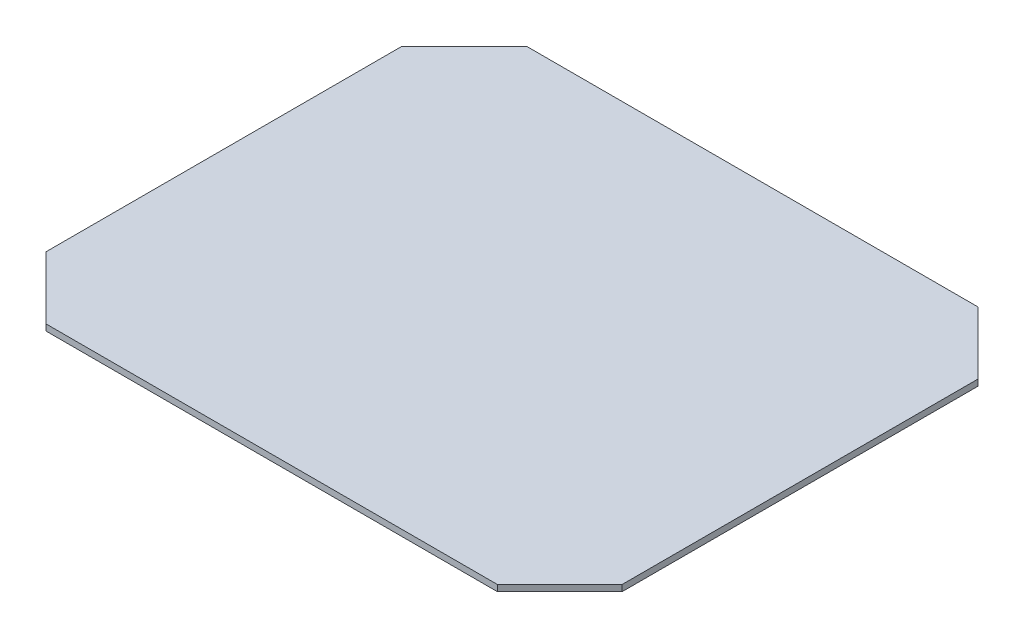
ISO-10303-21;
HEADER;
FILE_DESCRIPTION(('STEP AP214'),'2;1');
FILE_NAME('part.step','',(''),(''),'','','');
FILE_SCHEMA(('AUTOMOTIVE_DESIGN { 1 0 10303 214 1 1 1 1 }'));
ENDSEC;
DATA;
#1=APPLICATION_CONTEXT('core data for automotive mechanical design processes');
#2=APPLICATION_PROTOCOL_DEFINITION('international standard','automotive_design',2000,#1);
#3=PRODUCT_CONTEXT('',#1,'mechanical');
#4=PRODUCT('Part','Part','',(#3));
#5=PRODUCT_RELATED_PRODUCT_CATEGORY('part','',(#4));
#6=PRODUCT_DEFINITION_FORMATION('','',#4);
#7=PRODUCT_DEFINITION_CONTEXT('part definition',#1,'design');
#8=PRODUCT_DEFINITION('design','',#6,#7);
#9=PRODUCT_DEFINITION_SHAPE('','',#8);
#10=(LENGTH_UNIT() NAMED_UNIT(*) SI_UNIT(.MILLI.,.METRE.));
#11=(NAMED_UNIT(*) PLANE_ANGLE_UNIT() SI_UNIT($,.RADIAN.));
#12=(NAMED_UNIT(*) SI_UNIT($,.STERADIAN.) SOLID_ANGLE_UNIT());
#13=UNCERTAINTY_MEASURE_WITH_UNIT(LENGTH_MEASURE(1.E-05),#10,'distance_accuracy_value','');
#14=(GEOMETRIC_REPRESENTATION_CONTEXT(3) GLOBAL_UNCERTAINTY_ASSIGNED_CONTEXT((#13)) GLOBAL_UNIT_ASSIGNED_CONTEXT((#10,
#11,#12)) REPRESENTATION_CONTEXT('',''));
#15=CARTESIAN_POINT('',(0.,0.,0.));
#16=DIRECTION('',(0.,0.,1.));
#17=DIRECTION('',(1.,0.,0.));
#18=AXIS2_PLACEMENT_3D('',#15,#16,#17);
#19=CARTESIAN_POINT('',(459.105,6.35,-488.95));
#20=DIRECTION('',(0.,0.,1.));
#21=DIRECTION('',(1.,0.,0.));
#22=AXIS2_PLACEMENT_3D('',#19,#20,#21);
#23=PLANE('',#22);
#24=DIRECTION('',(-1.,0.,0.));
#25=VECTOR('',#24,1.);
#26=CARTESIAN_POINT('',(459.105,-6.35,-488.95));
#27=LINE('',#26,#25);
#28=CARTESIAN_POINT('',(459.105,-6.35,-488.95));
#29=VERTEX_POINT('',#28);
#30=CARTESIAN_POINT('',(-459.105,-6.35,-488.95));
#31=VERTEX_POINT('',#30);
#32=EDGE_CURVE('E144',#29,#31,#27,.T.);
#33=ORIENTED_EDGE('',*,*,#32,.T.);
#34=DIRECTION('',(0.,-1.,0.));
#35=VECTOR('',#34,1.);
#36=CARTESIAN_POINT('',(-459.105,6.35,-488.95));
#37=LINE('',#36,#35);
#38=CARTESIAN_POINT('',(-459.105,6.35,-488.95));
#39=VERTEX_POINT('',#38);
#40=EDGE_CURVE('E11',#39,#31,#37,.T.);
#41=ORIENTED_EDGE('',*,*,#40,.F.);
#42=DIRECTION('',(-1.,0.,0.));
#43=VECTOR('',#42,1.);
#44=CARTESIAN_POINT('',(459.105,6.35,-488.95));
#45=LINE('',#44,#43);
#46=CARTESIAN_POINT('',(459.105,6.35,-488.95));
#47=VERTEX_POINT('',#46);
#48=EDGE_CURVE('E166',#47,#39,#45,.T.);
#49=ORIENTED_EDGE('',*,*,#48,.F.);
#50=DIRECTION('',(0.,-1.,0.));
#51=VECTOR('',#50,1.);
#52=CARTESIAN_POINT('',(459.105,6.35,-488.95));
#53=LINE('',#52,#51);
#54=EDGE_CURVE('E140',#47,#29,#53,.T.);
#55=ORIENTED_EDGE('',*,*,#54,.T.);
#56=EDGE_LOOP('',(#33,#41,#49,#55));
#57=FACE_BOUND('',#56,.T.);
#58=ADVANCED_FACE('F43',(#57),#23,.F.);
#59=CARTESIAN_POINT('',(-459.105,6.35,-488.95));
#60=DIRECTION('',(0.707106781186547,0.,0.707106781186548));
#61=DIRECTION('',(0.707106781186548,0.,-0.707106781186547));
#62=AXIS2_PLACEMENT_3D('',#59,#60,#61);
#63=PLANE('',#62);
#64=DIRECTION('',(-0.707106781186548,0.,0.707106781186547));
#65=VECTOR('',#64,1.);
#66=CARTESIAN_POINT('',(-459.105,-6.35,-488.95));
#67=LINE('',#66,#65);
#68=CARTESIAN_POINT('',(-586.105,-6.35,-361.95));
#69=VERTEX_POINT('',#68);
#70=EDGE_CURVE('E148',#31,#69,#67,.T.);
#71=ORIENTED_EDGE('',*,*,#70,.T.);
#72=DIRECTION('',(0.,-1.,0.));
#73=VECTOR('',#72,1.);
#74=CARTESIAN_POINT('',(-586.105,6.35,-361.95));
#75=LINE('',#74,#73);
#76=CARTESIAN_POINT('',(-586.105,6.35,-361.95));
#77=VERTEX_POINT('',#76);
#78=EDGE_CURVE('E52',#77,#69,#75,.T.);
#79=ORIENTED_EDGE('',*,*,#78,.F.);
#80=DIRECTION('',(-0.707106781186548,0.,0.707106781186547));
#81=VECTOR('',#80,1.);
#82=CARTESIAN_POINT('',(-459.105,6.35,-488.95));
#83=LINE('',#82,#81);
#84=EDGE_CURVE('E103',#39,#77,#83,.T.);
#85=ORIENTED_EDGE('',*,*,#84,.F.);
#86=ORIENTED_EDGE('',*,*,#40,.T.);
#87=EDGE_LOOP('',(#71,#79,#85,#86));
#88=FACE_BOUND('',#87,.T.);
#89=ADVANCED_FACE('F212',(#88),#63,.F.);
#90=CARTESIAN_POINT('',(-586.105,6.35,-361.95));
#91=DIRECTION('',(1.,0.,0.));
#92=DIRECTION('',(0.,0.,-1.));
#93=AXIS2_PLACEMENT_3D('',#90,#91,#92);
#94=PLANE('',#93);
#95=DIRECTION('',(0.,0.,1.));
#96=VECTOR('',#95,1.);
#97=CARTESIAN_POINT('',(-586.105,-6.35,-361.95));
#98=LINE('',#97,#96);
#99=CARTESIAN_POINT('',(-586.105,-6.35,361.95));
#100=VERTEX_POINT('',#99);
#101=EDGE_CURVE('E151',#69,#100,#98,.T.);
#102=ORIENTED_EDGE('',*,*,#101,.T.);
#103=DIRECTION('',(0.,-1.,0.));
#104=VECTOR('',#103,1.);
#105=CARTESIAN_POINT('',(-586.105,6.35,361.95));
#106=LINE('',#105,#104);
#107=CARTESIAN_POINT('',(-586.105,6.35,361.95));
#108=VERTEX_POINT('',#107);
#109=EDGE_CURVE('E177',#108,#100,#106,.T.);
#110=ORIENTED_EDGE('',*,*,#109,.F.);
#111=DIRECTION('',(0.,0.,1.));
#112=VECTOR('',#111,1.);
#113=CARTESIAN_POINT('',(-586.105,6.35,-361.95));
#114=LINE('',#113,#112);
#115=EDGE_CURVE('E187',#77,#108,#114,.T.);
#116=ORIENTED_EDGE('',*,*,#115,.F.);
#117=ORIENTED_EDGE('',*,*,#78,.T.);
#118=EDGE_LOOP('',(#102,#110,#116,#117));
#119=FACE_BOUND('',#118,.T.);
#120=ADVANCED_FACE('F185',(#119),#94,.F.);
#121=CARTESIAN_POINT('',(-459.105,6.35,488.95));
#122=DIRECTION('',(0.707106781186548,0.,-0.707106781186547));
#123=DIRECTION('',(-0.707106781186547,0.,-0.707106781186548));
#124=AXIS2_PLACEMENT_3D('',#121,#122,#123);
#125=PLANE('',#124);
#126=DIRECTION('',(0.707106781186547,0.,0.707106781186548));
#127=VECTOR('',#126,1.);
#128=CARTESIAN_POINT('',(-459.105,-6.35,488.95));
#129=LINE('',#128,#127);
#130=CARTESIAN_POINT('',(-459.105,-6.35,488.95));
#131=VERTEX_POINT('',#130);
#132=EDGE_CURVE('E154',#100,#131,#129,.T.);
#133=ORIENTED_EDGE('',*,*,#132,.T.);
#134=DIRECTION('',(0.,-1.,0.));
#135=VECTOR('',#134,1.);
#136=CARTESIAN_POINT('',(-459.105,6.35,488.95));
#137=LINE('',#136,#135);
#138=CARTESIAN_POINT('',(-459.105,6.35,488.95));
#139=VERTEX_POINT('',#138);
#140=EDGE_CURVE('E173',#139,#131,#137,.T.);
#141=ORIENTED_EDGE('',*,*,#140,.F.);
#142=DIRECTION('',(0.707106781186547,0.,0.707106781186548));
#143=VECTOR('',#142,1.);
#144=CARTESIAN_POINT('',(-459.105,6.35,488.95));
#145=LINE('',#144,#143);
#146=EDGE_CURVE('E200',#108,#139,#145,.T.);
#147=ORIENTED_EDGE('',*,*,#146,.F.);
#148=ORIENTED_EDGE('',*,*,#109,.T.);
#149=EDGE_LOOP('',(#133,#141,#147,#148));
#150=FACE_BOUND('',#149,.T.);
#151=ADVANCED_FACE('F195',(#150),#125,.F.);
#152=CARTESIAN_POINT('',(459.105,6.35,488.95));
#153=DIRECTION('',(0.,0.,-1.));
#154=DIRECTION('',(-1.,0.,0.));
#155=AXIS2_PLACEMENT_3D('',#152,#153,#154);
#156=PLANE('',#155);
#157=DIRECTION('',(1.,0.,0.));
#158=VECTOR('',#157,1.);
#159=CARTESIAN_POINT('',(459.105,-6.35,488.95));
#160=LINE('',#159,#158);
#161=CARTESIAN_POINT('',(459.105,-6.35,488.95));
#162=VERTEX_POINT('',#161);
#163=EDGE_CURVE('E157',#131,#162,#160,.T.);
#164=ORIENTED_EDGE('',*,*,#163,.T.);
#165=DIRECTION('',(0.,-1.,0.));
#166=VECTOR('',#165,1.);
#167=CARTESIAN_POINT('',(459.105,6.35,488.95));
#168=LINE('',#167,#166);
#169=CARTESIAN_POINT('',(459.105,6.35,488.95));
#170=VERTEX_POINT('',#169);
#171=EDGE_CURVE('E133',#170,#162,#168,.T.);
#172=ORIENTED_EDGE('',*,*,#171,.F.);
#173=DIRECTION('',(1.,0.,0.));
#174=VECTOR('',#173,1.);
#175=CARTESIAN_POINT('',(459.105,6.35,488.95));
#176=LINE('',#175,#174);
#177=EDGE_CURVE('E122',#139,#170,#176,.T.);
#178=ORIENTED_EDGE('',*,*,#177,.F.);
#179=ORIENTED_EDGE('',*,*,#140,.T.);
#180=EDGE_LOOP('',(#164,#172,#178,#179));
#181=FACE_BOUND('',#180,.T.);
#182=ADVANCED_FACE('F198',(#181),#156,.F.);
#183=CARTESIAN_POINT('',(586.105,6.35,361.95));
#184=DIRECTION('',(-0.707106781186547,0.,-0.707106781186548));
#185=DIRECTION('',(-0.707106781186548,0.,0.707106781186547));
#186=AXIS2_PLACEMENT_3D('',#183,#184,#185);
#187=PLANE('',#186);
#188=DIRECTION('',(0.707106781186548,0.,-0.707106781186547));
#189=VECTOR('',#188,1.);
#190=CARTESIAN_POINT('',(586.105,-6.35,361.95));
#191=LINE('',#190,#189);
#192=CARTESIAN_POINT('',(586.105,-6.35,361.95));
#193=VERTEX_POINT('',#192);
#194=EDGE_CURVE('E131',#162,#193,#191,.T.);
#195=ORIENTED_EDGE('',*,*,#194,.T.);
#196=DIRECTION('',(0.,-1.,0.));
#197=VECTOR('',#196,1.);
#198=CARTESIAN_POINT('',(586.105,6.35,361.95));
#199=LINE('',#198,#197);
#200=CARTESIAN_POINT('',(586.105,6.35,361.95));
#201=VERTEX_POINT('',#200);
#202=EDGE_CURVE('E128',#201,#193,#199,.T.);
#203=ORIENTED_EDGE('',*,*,#202,.F.);
#204=DIRECTION('',(0.707106781186548,0.,-0.707106781186547));
#205=VECTOR('',#204,1.);
#206=CARTESIAN_POINT('',(586.105,6.35,361.95));
#207=LINE('',#206,#205);
#208=EDGE_CURVE('E116',#170,#201,#207,.T.);
#209=ORIENTED_EDGE('',*,*,#208,.F.);
#210=ORIENTED_EDGE('',*,*,#171,.T.);
#211=EDGE_LOOP('',(#195,#203,#209,#210));
#212=FACE_BOUND('',#211,.T.);
#213=ADVANCED_FACE('F129',(#212),#187,.F.);
#214=CARTESIAN_POINT('',(586.105,6.35,-361.95));
#215=DIRECTION('',(-1.,0.,0.));
#216=DIRECTION('',(0.,0.,1.));
#217=AXIS2_PLACEMENT_3D('',#214,#215,#216);
#218=PLANE('',#217);
#219=DIRECTION('',(0.,0.,-1.));
#220=VECTOR('',#219,1.);
#221=CARTESIAN_POINT('',(586.105,-6.35,-361.95));
#222=LINE('',#221,#220);
#223=CARTESIAN_POINT('',(586.105,-6.35,-361.95));
#224=VERTEX_POINT('',#223);
#225=EDGE_CURVE('E89',#193,#224,#222,.T.);
#226=ORIENTED_EDGE('',*,*,#225,.T.);
#227=DIRECTION('',(0.,-1.,0.));
#228=VECTOR('',#227,1.);
#229=CARTESIAN_POINT('',(586.105,6.35,-361.95));
#230=LINE('',#229,#228);
#231=CARTESIAN_POINT('',(586.105,6.35,-361.95));
#232=VERTEX_POINT('',#231);
#233=EDGE_CURVE('E134',#232,#224,#230,.T.);
#234=ORIENTED_EDGE('',*,*,#233,.F.);
#235=DIRECTION('',(0.,0.,-1.));
#236=VECTOR('',#235,1.);
#237=CARTESIAN_POINT('',(586.105,6.35,-361.95));
#238=LINE('',#237,#236);
#239=EDGE_CURVE('E120',#201,#232,#238,.T.);
#240=ORIENTED_EDGE('',*,*,#239,.F.);
#241=ORIENTED_EDGE('',*,*,#202,.T.);
#242=EDGE_LOOP('',(#226,#234,#240,#241));
#243=FACE_BOUND('',#242,.T.);
#244=ADVANCED_FACE('F136',(#243),#218,.F.);
#245=CARTESIAN_POINT('',(586.105,6.35,-361.95));
#246=DIRECTION('',(-0.707106781186548,0.,0.707106781186548));
#247=DIRECTION('',(0.707106781186548,0.,0.707106781186548));
#248=AXIS2_PLACEMENT_3D('',#245,#246,#247);
#249=PLANE('',#248);
#250=DIRECTION('',(-0.707106781186548,0.,-0.707106781186548));
#251=VECTOR('',#250,1.);
#252=CARTESIAN_POINT('',(586.105,-6.35,-361.95));
#253=LINE('',#252,#251);
#254=EDGE_CURVE('E95',#224,#29,#253,.T.);
#255=ORIENTED_EDGE('',*,*,#254,.T.);
#256=ORIENTED_EDGE('',*,*,#54,.F.);
#257=DIRECTION('',(-0.707106781186548,0.,-0.707106781186548));
#258=VECTOR('',#257,1.);
#259=CARTESIAN_POINT('',(586.105,6.35,-361.95));
#260=LINE('',#259,#258);
#261=EDGE_CURVE('E60',#232,#47,#260,.T.);
#262=ORIENTED_EDGE('',*,*,#261,.F.);
#263=ORIENTED_EDGE('',*,*,#233,.T.);
#264=EDGE_LOOP('',(#255,#256,#262,#263));
#265=FACE_BOUND('',#264,.T.);
#266=ADVANCED_FACE('F228',(#265),#249,.F.);
#267=CARTESIAN_POINT('',(0.,6.35,0.));
#268=DIRECTION('',(0.,1.,0.));
#269=DIRECTION('',(0.,0.,1.));
#270=AXIS2_PLACEMENT_3D('',#267,#268,#269);
#271=PLANE('',#270);
#272=ORIENTED_EDGE('',*,*,#48,.T.);
#273=ORIENTED_EDGE('',*,*,#84,.T.);
#274=ORIENTED_EDGE('',*,*,#115,.T.);
#275=ORIENTED_EDGE('',*,*,#146,.T.);
#276=ORIENTED_EDGE('',*,*,#177,.T.);
#277=ORIENTED_EDGE('',*,*,#208,.T.);
#278=ORIENTED_EDGE('',*,*,#239,.T.);
#279=ORIENTED_EDGE('',*,*,#261,.T.);
#280=EDGE_LOOP('',(#272,#273,#274,#275,#276,#277,#278,#279));
#281=FACE_BOUND('',#280,.T.);
#282=ADVANCED_FACE('F118',(#281),#271,.T.);
#283=CARTESIAN_POINT('',(0.,-6.35,0.));
#284=DIRECTION('',(0.,1.,0.));
#285=DIRECTION('',(0.,0.,1.));
#286=AXIS2_PLACEMENT_3D('',#283,#284,#285);
#287=PLANE('',#286);
#288=ORIENTED_EDGE('',*,*,#32,.F.);
#289=ORIENTED_EDGE('',*,*,#254,.F.);
#290=ORIENTED_EDGE('',*,*,#225,.F.);
#291=ORIENTED_EDGE('',*,*,#194,.F.);
#292=ORIENTED_EDGE('',*,*,#163,.F.);
#293=ORIENTED_EDGE('',*,*,#132,.F.);
#294=ORIENTED_EDGE('',*,*,#101,.F.);
#295=ORIENTED_EDGE('',*,*,#70,.F.);
#296=EDGE_LOOP('',(#288,#289,#290,#291,#292,#293,#294,#295));
#297=FACE_BOUND('',#296,.T.);
#298=ADVANCED_FACE('F191',(#297),#287,.F.);
#299=CLOSED_SHELL('',(#58,#89,#120,#151,#182,#213,#244,#266,#282,#298));
#300=MANIFOLD_SOLID_BREP('B2',#299);
#301=ADVANCED_BREP_SHAPE_REPRESENTATION('',(#18,#300),#14);
#302=SHAPE_DEFINITION_REPRESENTATION(#9,#301);
ENDSEC;
END-ISO-10303-21;
